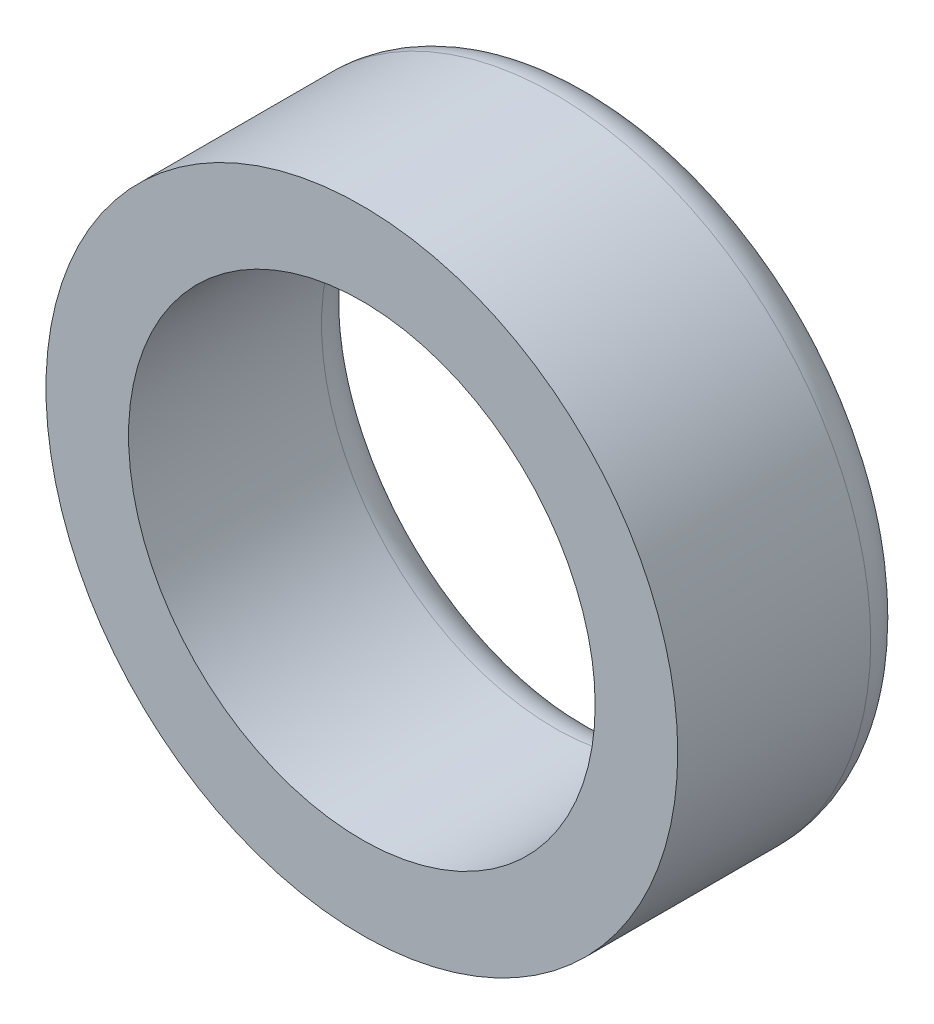
ISO-10303-21;
HEADER;
FILE_DESCRIPTION(('STEP AP214'),'2;1');
FILE_NAME('part.step','',(''),(''),'','','');
FILE_SCHEMA(('AUTOMOTIVE_DESIGN { 1 0 10303 214 1 1 1 1 }'));
ENDSEC;
DATA;
#1=APPLICATION_CONTEXT('core data for automotive mechanical design processes');
#2=APPLICATION_PROTOCOL_DEFINITION('international standard','automotive_design',2000,#1);
#3=PRODUCT_CONTEXT('',#1,'mechanical');
#4=PRODUCT('Part','Part','',(#3));
#5=PRODUCT_RELATED_PRODUCT_CATEGORY('part','',(#4));
#6=PRODUCT_DEFINITION_FORMATION('','',#4);
#7=PRODUCT_DEFINITION_CONTEXT('part definition',#1,'design');
#8=PRODUCT_DEFINITION('design','',#6,#7);
#9=PRODUCT_DEFINITION_SHAPE('','',#8);
#10=(LENGTH_UNIT() NAMED_UNIT(*) SI_UNIT(.MILLI.,.METRE.));
#11=(NAMED_UNIT(*) PLANE_ANGLE_UNIT() SI_UNIT($,.RADIAN.));
#12=(NAMED_UNIT(*) SI_UNIT($,.STERADIAN.) SOLID_ANGLE_UNIT());
#13=UNCERTAINTY_MEASURE_WITH_UNIT(LENGTH_MEASURE(1.E-05),#10,'distance_accuracy_value','');
#14=(GEOMETRIC_REPRESENTATION_CONTEXT(3) GLOBAL_UNCERTAINTY_ASSIGNED_CONTEXT((#13)) GLOBAL_UNIT_ASSIGNED_CONTEXT((#10,
#11,#12)) REPRESENTATION_CONTEXT('',''));
#15=CARTESIAN_POINT('',(0.,0.,0.));
#16=DIRECTION('',(0.,0.,1.));
#17=DIRECTION('',(1.,0.,0.));
#18=AXIS2_PLACEMENT_3D('',#15,#16,#17);
#19=CARTESIAN_POINT('',(0.,0.,-5.025));
#20=DIRECTION('',(0.,0.,1.));
#21=DIRECTION('',(1.,0.,0.));
#22=AXIS2_PLACEMENT_3D('',#19,#20,#21);
#23=TOROIDAL_SURFACE('',#22,7.15,1.075);
#24=CARTESIAN_POINT('',(0.,0.,-5.025));
#25=DIRECTION('',(0.,0.,1.));
#26=DIRECTION('',(1.,0.,0.));
#27=AXIS2_PLACEMENT_3D('',#24,#25,#26);
#28=CIRCLE('',#27,8.225);
#29=CARTESIAN_POINT('',(8.225,0.,-5.025));
#30=VERTEX_POINT('',#29);
#31=EDGE_CURVE('E40',#30,#30,#28,.T.);
#32=ORIENTED_EDGE('',*,*,#31,.F.);
#33=EDGE_LOOP('',(#32));
#34=FACE_BOUND('',#33,.T.);
#35=CARTESIAN_POINT('',(0.,0.,-5.025));
#36=DIRECTION('',(0.,0.,1.));
#37=DIRECTION('',(1.,0.,0.));
#38=AXIS2_PLACEMENT_3D('',#35,#36,#37);
#39=CIRCLE('',#38,6.075);
#40=CARTESIAN_POINT('',(6.075,0.,-5.025));
#41=VERTEX_POINT('',#40);
#42=EDGE_CURVE('E10',#41,#41,#39,.F.);
#43=ORIENTED_EDGE('',*,*,#42,.F.);
#44=EDGE_LOOP('',(#43));
#45=FACE_BOUND('',#44,.T.);
#46=ADVANCED_FACE('F33',(#34,#45),#23,.T.);
#47=CARTESIAN_POINT('',(0.,0.,-6.1));
#48=DIRECTION('',(0.,0.,1.));
#49=DIRECTION('',(1.,0.,0.));
#50=AXIS2_PLACEMENT_3D('',#47,#48,#49);
#51=CYLINDRICAL_SURFACE('',#50,8.225);
#52=ORIENTED_EDGE('',*,*,#31,.T.);
#53=EDGE_LOOP('',(#52));
#54=FACE_BOUND('',#53,.T.);
#55=CARTESIAN_POINT('',(0.,0.,0.));
#56=DIRECTION('',(0.,0.,1.));
#57=DIRECTION('',(1.,0.,0.));
#58=AXIS2_PLACEMENT_3D('',#55,#56,#57);
#59=CIRCLE('',#58,8.225);
#60=CARTESIAN_POINT('',(8.225,0.,0.));
#61=VERTEX_POINT('',#60);
#62=EDGE_CURVE('E44',#61,#61,#59,.T.);
#63=ORIENTED_EDGE('',*,*,#62,.F.);
#64=EDGE_LOOP('',(#63));
#65=FACE_BOUND('',#64,.T.);
#66=ADVANCED_FACE('F59',(#54,#65),#51,.T.);
#67=CARTESIAN_POINT('',(0.,0.,0.));
#68=DIRECTION('',(0.,0.,1.));
#69=DIRECTION('',(1.,0.,0.));
#70=AXIS2_PLACEMENT_3D('',#67,#68,#69);
#71=PLANE('',#70);
#72=CARTESIAN_POINT('',(0.,0.,0.));
#73=DIRECTION('',(0.,0.,1.));
#74=DIRECTION('',(1.,0.,0.));
#75=AXIS2_PLACEMENT_3D('',#72,#73,#74);
#76=CIRCLE('',#75,6.075);
#77=CARTESIAN_POINT('',(6.075,0.,0.));
#78=VERTEX_POINT('',#77);
#79=EDGE_CURVE('E48',#78,#78,#76,.T.);
#80=ORIENTED_EDGE('',*,*,#79,.F.);
#81=EDGE_LOOP('',(#80));
#82=FACE_BOUND('',#81,.T.);
#83=ORIENTED_EDGE('',*,*,#62,.T.);
#84=EDGE_LOOP('',(#83));
#85=FACE_BOUND('',#84,.T.);
#86=ADVANCED_FACE('F56',(#82,#85),#71,.T.);
#87=CARTESIAN_POINT('',(0.,0.,-6.1));
#88=DIRECTION('',(0.,0.,1.));
#89=DIRECTION('',(1.,0.,0.));
#90=AXIS2_PLACEMENT_3D('',#87,#88,#89);
#91=CYLINDRICAL_SURFACE('',#90,6.075);
#92=ORIENTED_EDGE('',*,*,#42,.T.);
#93=EDGE_LOOP('',(#92));
#94=FACE_BOUND('',#93,.T.);
#95=ORIENTED_EDGE('',*,*,#79,.T.);
#96=EDGE_LOOP('',(#95));
#97=FACE_BOUND('',#96,.T.);
#98=ADVANCED_FACE('F54',(#94,#97),#91,.F.);
#99=CLOSED_SHELL('',(#46,#66,#86,#98));
#100=MANIFOLD_SOLID_BREP('B2',#99);
#101=ADVANCED_BREP_SHAPE_REPRESENTATION('',(#18,#100),#14);
#102=SHAPE_DEFINITION_REPRESENTATION(#9,#101);
ENDSEC;
END-ISO-10303-21;
